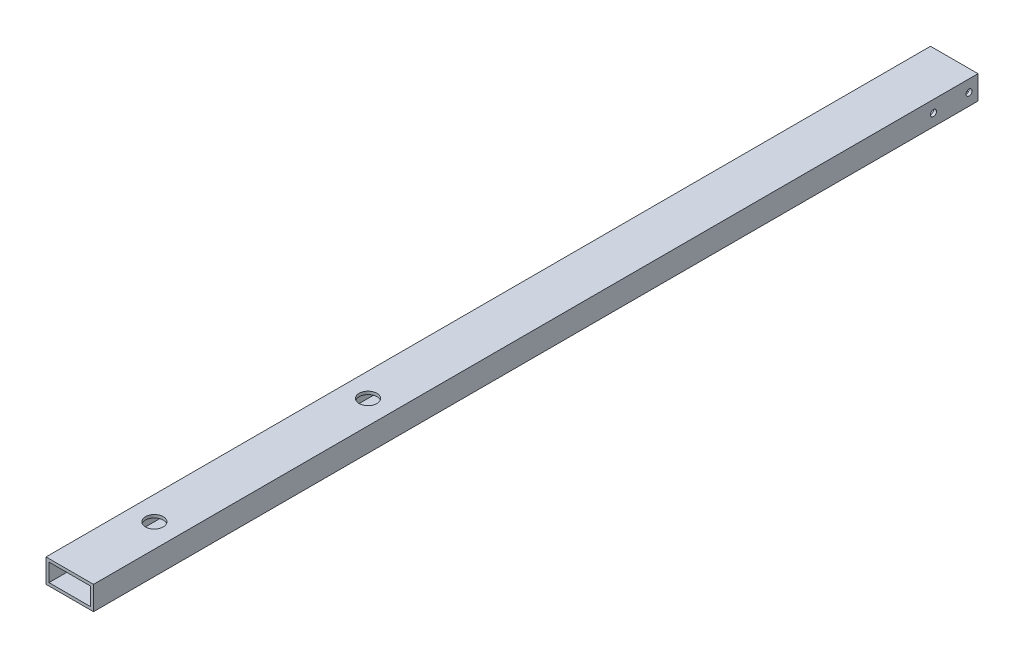
ISO-10303-21;
HEADER;
FILE_DESCRIPTION(('STEP AP214'),'2;1');
FILE_NAME('part.step','',(''),(''),'','','');
FILE_SCHEMA(('AUTOMOTIVE_DESIGN { 1 0 10303 214 1 1 1 1 }'));
ENDSEC;
DATA;
#1=APPLICATION_CONTEXT('core data for automotive mechanical design processes');
#2=APPLICATION_PROTOCOL_DEFINITION('international standard','automotive_design',2000,#1);
#3=PRODUCT_CONTEXT('',#1,'mechanical');
#4=PRODUCT('Part','Part','',(#3));
#5=PRODUCT_RELATED_PRODUCT_CATEGORY('part','',(#4));
#6=PRODUCT_DEFINITION_FORMATION('','',#4);
#7=PRODUCT_DEFINITION_CONTEXT('part definition',#1,'design');
#8=PRODUCT_DEFINITION('design','',#6,#7);
#9=PRODUCT_DEFINITION_SHAPE('','',#8);
#10=(LENGTH_UNIT() NAMED_UNIT(*) SI_UNIT(.MILLI.,.METRE.));
#11=(NAMED_UNIT(*) PLANE_ANGLE_UNIT() SI_UNIT($,.RADIAN.));
#12=(NAMED_UNIT(*) SI_UNIT($,.STERADIAN.) SOLID_ANGLE_UNIT());
#13=UNCERTAINTY_MEASURE_WITH_UNIT(LENGTH_MEASURE(1.E-05),#10,'distance_accuracy_value','');
#14=(GEOMETRIC_REPRESENTATION_CONTEXT(3) GLOBAL_UNCERTAINTY_ASSIGNED_CONTEXT((#13)) GLOBAL_UNIT_ASSIGNED_CONTEXT((#10,
#11,#12)) REPRESENTATION_CONTEXT('',''));
#15=CARTESIAN_POINT('',(0.,0.,0.));
#16=DIRECTION('',(0.,0.,1.));
#17=DIRECTION('',(1.,0.,0.));
#18=AXIS2_PLACEMENT_3D('',#15,#16,#17);
#19=CARTESIAN_POINT('',(25.4,12.039999999,855.6752));
#20=DIRECTION('',(0.,1.,0.));
#21=DIRECTION('',(0.,0.,1.));
#22=AXIS2_PLACEMENT_3D('',#19,#20,#21);
#23=CYLINDRICAL_SURFACE('',#22,9.525);
#24=CARTESIAN_POINT('',(25.4,0.,855.6752));
#25=DIRECTION('',(0.,1.,0.));
#26=DIRECTION('',(0.,0.,1.));
#27=AXIS2_PLACEMENT_3D('',#24,#25,#26);
#28=CIRCLE('',#27,9.525);
#29=CARTESIAN_POINT('',(25.4,0.,865.2002));
#30=VERTEX_POINT('',#29);
#31=EDGE_CURVE('E20',#30,#30,#28,.T.);
#32=ORIENTED_EDGE('',*,*,#31,.F.);
#33=EDGE_LOOP('',(#32));
#34=FACE_BOUND('',#33,.T.);
#35=CARTESIAN_POINT('',(25.4,3.175,855.6752));
#36=DIRECTION('',(0.,1.,0.));
#37=DIRECTION('',(0.,0.,1.));
#38=AXIS2_PLACEMENT_3D('',#35,#36,#37);
#39=CIRCLE('',#38,9.525);
#40=CARTESIAN_POINT('',(25.4,3.175,865.2002));
#41=VERTEX_POINT('',#40);
#42=EDGE_CURVE('E125',#41,#41,#39,.T.);
#43=ORIENTED_EDGE('',*,*,#42,.T.);
#44=EDGE_LOOP('',(#43));
#45=FACE_BOUND('',#44,.T.);
#46=ADVANCED_FACE('F17',(#34,#45),#23,.F.);
#47=CARTESIAN_POINT('',(25.4,12.039999999,627.0752));
#48=DIRECTION('',(0.,1.,0.));
#49=DIRECTION('',(0.,0.,1.));
#50=AXIS2_PLACEMENT_3D('',#47,#48,#49);
#51=CYLINDRICAL_SURFACE('',#50,9.525);
#52=CARTESIAN_POINT('',(25.4,0.,627.0752));
#53=DIRECTION('',(0.,1.,0.));
#54=DIRECTION('',(0.,0.,1.));
#55=AXIS2_PLACEMENT_3D('',#52,#53,#54);
#56=CIRCLE('',#55,9.525);
#57=CARTESIAN_POINT('',(25.4,0.,636.6002));
#58=VERTEX_POINT('',#57);
#59=EDGE_CURVE('E163',#58,#58,#56,.T.);
#60=ORIENTED_EDGE('',*,*,#59,.F.);
#61=EDGE_LOOP('',(#60));
#62=FACE_BOUND('',#61,.T.);
#63=CARTESIAN_POINT('',(25.4,3.175,627.0752));
#64=DIRECTION('',(0.,1.,0.));
#65=DIRECTION('',(0.,0.,1.));
#66=AXIS2_PLACEMENT_3D('',#63,#64,#65);
#67=CIRCLE('',#66,9.525);
#68=CARTESIAN_POINT('',(25.4,3.175,636.6002));
#69=VERTEX_POINT('',#68);
#70=EDGE_CURVE('E123',#69,#69,#67,.T.);
#71=ORIENTED_EDGE('',*,*,#70,.T.);
#72=EDGE_LOOP('',(#71));
#73=FACE_BOUND('',#72,.T.);
#74=ADVANCED_FACE('F175',(#62,#73),#51,.F.);
#75=CARTESIAN_POINT('',(24.7399999992,12.7,47.625));
#76=DIRECTION('',(1.,0.,0.));
#77=DIRECTION('',(0.,0.,-1.));
#78=AXIS2_PLACEMENT_3D('',#75,#76,#77);
#79=CYLINDRICAL_SURFACE('',#78,3.2639);
#80=CARTESIAN_POINT('',(50.8,12.7,47.625));
#81=DIRECTION('',(1.,0.,0.));
#82=DIRECTION('',(0.,0.,-1.));
#83=AXIS2_PLACEMENT_3D('',#80,#81,#82);
#84=CIRCLE('',#83,3.2639);
#85=CARTESIAN_POINT('',(50.8,12.7,44.3611));
#86=VERTEX_POINT('',#85);
#87=EDGE_CURVE('E118',#86,#86,#84,.F.);
#88=ORIENTED_EDGE('',*,*,#87,.F.);
#89=EDGE_LOOP('',(#88));
#90=FACE_BOUND('',#89,.T.);
#91=CARTESIAN_POINT('',(47.625,12.7,47.625));
#92=DIRECTION('',(1.,0.,0.));
#93=DIRECTION('',(0.,0.,-1.));
#94=AXIS2_PLACEMENT_3D('',#91,#92,#93);
#95=CIRCLE('',#94,3.2639);
#96=CARTESIAN_POINT('',(47.625,12.7,44.3611));
#97=VERTEX_POINT('',#96);
#98=EDGE_CURVE('E161',#97,#97,#95,.F.);
#99=ORIENTED_EDGE('',*,*,#98,.T.);
#100=EDGE_LOOP('',(#99));
#101=FACE_BOUND('',#100,.T.);
#102=ADVANCED_FACE('F287',(#90,#101),#79,.F.);
#103=CARTESIAN_POINT('',(24.7399999992,12.7,9.525));
#104=DIRECTION('',(1.,0.,0.));
#105=DIRECTION('',(0.,0.,-1.));
#106=AXIS2_PLACEMENT_3D('',#103,#104,#105);
#107=CYLINDRICAL_SURFACE('',#106,3.2639);
#108=CARTESIAN_POINT('',(50.8,12.7,9.525));
#109=DIRECTION('',(1.,0.,0.));
#110=DIRECTION('',(0.,0.,-1.));
#111=AXIS2_PLACEMENT_3D('',#108,#109,#110);
#112=CIRCLE('',#111,3.2639);
#113=CARTESIAN_POINT('',(50.8,12.7,6.2611));
#114=VERTEX_POINT('',#113);
#115=EDGE_CURVE('E114',#114,#114,#112,.F.);
#116=ORIENTED_EDGE('',*,*,#115,.F.);
#117=EDGE_LOOP('',(#116));
#118=FACE_BOUND('',#117,.T.);
#119=CARTESIAN_POINT('',(47.625,12.7,9.525));
#120=DIRECTION('',(1.,0.,0.));
#121=DIRECTION('',(0.,0.,-1.));
#122=AXIS2_PLACEMENT_3D('',#119,#120,#121);
#123=CIRCLE('',#122,3.2639);
#124=CARTESIAN_POINT('',(47.625,12.7,6.2611));
#125=VERTEX_POINT('',#124);
#126=EDGE_CURVE('E126',#125,#125,#123,.F.);
#127=ORIENTED_EDGE('',*,*,#126,.T.);
#128=EDGE_LOOP('',(#127));
#129=FACE_BOUND('',#128,.T.);
#130=ADVANCED_FACE('F283',(#118,#129),#107,.F.);
#131=CARTESIAN_POINT('',(24.7399999992,12.7,47.625));
#132=DIRECTION('',(1.,0.,0.));
#133=DIRECTION('',(0.,0.,-1.));
#134=AXIS2_PLACEMENT_3D('',#131,#132,#133);
#135=CYLINDRICAL_SURFACE('',#134,3.2639);
#136=CARTESIAN_POINT('',(0.,12.7,47.625));
#137=DIRECTION('',(1.,0.,0.));
#138=DIRECTION('',(0.,0.,-1.));
#139=AXIS2_PLACEMENT_3D('',#136,#137,#138);
#140=CIRCLE('',#139,3.2639);
#141=CARTESIAN_POINT('',(0.,12.7,44.3611));
#142=VERTEX_POINT('',#141);
#143=EDGE_CURVE('E143',#142,#142,#140,.T.);
#144=ORIENTED_EDGE('',*,*,#143,.F.);
#145=EDGE_LOOP('',(#144));
#146=FACE_BOUND('',#145,.T.);
#147=CARTESIAN_POINT('',(3.175,12.7,47.625));
#148=DIRECTION('',(1.,0.,0.));
#149=DIRECTION('',(0.,0.,-1.));
#150=AXIS2_PLACEMENT_3D('',#147,#148,#149);
#151=CIRCLE('',#150,3.2639);
#152=CARTESIAN_POINT('',(3.175,12.7,44.3611));
#153=VERTEX_POINT('',#152);
#154=EDGE_CURVE('E122',#153,#153,#151,.T.);
#155=ORIENTED_EDGE('',*,*,#154,.T.);
#156=EDGE_LOOP('',(#155));
#157=FACE_BOUND('',#156,.T.);
#158=ADVANCED_FACE('F279',(#146,#157),#135,.F.);
#159=CARTESIAN_POINT('',(24.7399999992,12.7,9.525));
#160=DIRECTION('',(1.,0.,0.));
#161=DIRECTION('',(0.,0.,-1.));
#162=AXIS2_PLACEMENT_3D('',#159,#160,#161);
#163=CYLINDRICAL_SURFACE('',#162,3.2639);
#164=CARTESIAN_POINT('',(0.,12.7,9.525));
#165=DIRECTION('',(1.,0.,0.));
#166=DIRECTION('',(0.,0.,-1.));
#167=AXIS2_PLACEMENT_3D('',#164,#165,#166);
#168=CIRCLE('',#167,3.2639);
#169=CARTESIAN_POINT('',(0.,12.7,6.2611));
#170=VERTEX_POINT('',#169);
#171=EDGE_CURVE('E139',#170,#170,#168,.T.);
#172=ORIENTED_EDGE('',*,*,#171,.F.);
#173=EDGE_LOOP('',(#172));
#174=FACE_BOUND('',#173,.T.);
#175=CARTESIAN_POINT('',(3.175,12.7,9.525));
#176=DIRECTION('',(1.,0.,0.));
#177=DIRECTION('',(0.,0.,-1.));
#178=AXIS2_PLACEMENT_3D('',#175,#176,#177);
#179=CIRCLE('',#178,3.2639);
#180=CARTESIAN_POINT('',(3.175,12.7,6.2611));
#181=VERTEX_POINT('',#180);
#182=EDGE_CURVE('E91',#181,#181,#179,.T.);
#183=ORIENTED_EDGE('',*,*,#182,.T.);
#184=EDGE_LOOP('',(#183));
#185=FACE_BOUND('',#184,.T.);
#186=ADVANCED_FACE('F276',(#174,#185),#163,.F.);
#187=CARTESIAN_POINT('',(0.,0.,0.));
#188=DIRECTION('',(0.,-1.,0.));
#189=DIRECTION('',(0.,0.,-1.));
#190=AXIS2_PLACEMENT_3D('',#187,#188,#189);
#191=PLANE('',#190);
#192=ORIENTED_EDGE('',*,*,#59,.T.);
#193=EDGE_LOOP('',(#192));
#194=FACE_BOUND('',#193,.T.);
#195=ORIENTED_EDGE('',*,*,#31,.T.);
#196=EDGE_LOOP('',(#195));
#197=FACE_BOUND('',#196,.T.);
#198=DIRECTION('',(0.,0.,-1.));
#199=VECTOR('',#198,1.);
#200=CARTESIAN_POINT('',(50.8,0.,0.));
#201=LINE('',#200,#199);
#202=CARTESIAN_POINT('',(50.8,0.,946.15));
#203=VERTEX_POINT('',#202);
#204=CARTESIAN_POINT('',(50.8,0.,0.));
#205=VERTEX_POINT('',#204);
#206=EDGE_CURVE('E115',#203,#205,#201,.T.);
#207=ORIENTED_EDGE('',*,*,#206,.F.);
#208=DIRECTION('',(1.,0.,0.));
#209=VECTOR('',#208,1.);
#210=CARTESIAN_POINT('',(0.,0.,946.15));
#211=LINE('',#210,#209);
#212=CARTESIAN_POINT('',(0.,0.,946.15));
#213=VERTEX_POINT('',#212);
#214=EDGE_CURVE('E142',#213,#203,#211,.T.);
#215=ORIENTED_EDGE('',*,*,#214,.F.);
#216=DIRECTION('',(0.,0.,1.));
#217=VECTOR('',#216,1.);
#218=CARTESIAN_POINT('',(0.,0.,0.));
#219=LINE('',#218,#217);
#220=CARTESIAN_POINT('',(0.,0.,0.));
#221=VERTEX_POINT('',#220);
#222=EDGE_CURVE('E146',#221,#213,#219,.T.);
#223=ORIENTED_EDGE('',*,*,#222,.F.);
#224=DIRECTION('',(1.,0.,0.));
#225=VECTOR('',#224,1.);
#226=CARTESIAN_POINT('',(0.,0.,0.));
#227=LINE('',#226,#225);
#228=EDGE_CURVE('E111',#221,#205,#227,.T.);
#229=ORIENTED_EDGE('',*,*,#228,.T.);
#230=EDGE_LOOP('',(#207,#215,#223,#229));
#231=FACE_BOUND('',#230,.T.);
#232=ADVANCED_FACE('F170',(#194,#197,#231),#191,.T.);
#233=CARTESIAN_POINT('',(47.625,3.175,0.));
#234=DIRECTION('',(1.,0.,0.));
#235=DIRECTION('',(0.,0.,-1.));
#236=AXIS2_PLACEMENT_3D('',#233,#234,#235);
#237=PLANE('',#236);
#238=ORIENTED_EDGE('',*,*,#126,.F.);
#239=EDGE_LOOP('',(#238));
#240=FACE_BOUND('',#239,.T.);
#241=ORIENTED_EDGE('',*,*,#98,.F.);
#242=EDGE_LOOP('',(#241));
#243=FACE_BOUND('',#242,.T.);
#244=DIRECTION('',(0.,0.,1.));
#245=VECTOR('',#244,1.);
#246=CARTESIAN_POINT('',(47.625,22.225,0.));
#247=LINE('',#246,#245);
#248=CARTESIAN_POINT('',(47.625,22.225,946.15));
#249=VERTEX_POINT('',#248);
#250=CARTESIAN_POINT('',(47.625,22.225,0.));
#251=VERTEX_POINT('',#250);
#252=EDGE_CURVE('E79',#249,#251,#247,.F.);
#253=ORIENTED_EDGE('',*,*,#252,.T.);
#254=DIRECTION('',(0.,1.,0.));
#255=VECTOR('',#254,1.);
#256=CARTESIAN_POINT('',(47.625,0.,0.));
#257=LINE('',#256,#255);
#258=CARTESIAN_POINT('',(47.625,3.175,0.));
#259=VERTEX_POINT('',#258);
#260=EDGE_CURVE('E83',#251,#259,#257,.F.);
#261=ORIENTED_EDGE('',*,*,#260,.T.);
#262=DIRECTION('',(0.,0.,-1.));
#263=VECTOR('',#262,1.);
#264=CARTESIAN_POINT('',(47.625,3.175,0.));
#265=LINE('',#264,#263);
#266=CARTESIAN_POINT('',(47.625,3.175,946.15));
#267=VERTEX_POINT('',#266);
#268=EDGE_CURVE('E124',#259,#267,#265,.F.);
#269=ORIENTED_EDGE('',*,*,#268,.T.);
#270=DIRECTION('',(0.,1.,0.));
#271=VECTOR('',#270,1.);
#272=CARTESIAN_POINT('',(47.625,0.,946.15));
#273=LINE('',#272,#271);
#274=EDGE_CURVE('E86',#249,#267,#273,.F.);
#275=ORIENTED_EDGE('',*,*,#274,.F.);
#276=EDGE_LOOP('',(#253,#261,#269,#275));
#277=FACE_BOUND('',#276,.T.);
#278=ADVANCED_FACE('F81',(#240,#243,#277),#237,.F.);
#279=CARTESIAN_POINT('',(3.175,3.175,0.));
#280=DIRECTION('',(0.,-1.,0.));
#281=DIRECTION('',(0.,0.,-1.));
#282=AXIS2_PLACEMENT_3D('',#279,#280,#281);
#283=PLANE('',#282);
#284=ORIENTED_EDGE('',*,*,#70,.F.);
#285=EDGE_LOOP('',(#284));
#286=FACE_BOUND('',#285,.T.);
#287=ORIENTED_EDGE('',*,*,#42,.F.);
#288=EDGE_LOOP('',(#287));
#289=FACE_BOUND('',#288,.T.);
#290=ORIENTED_EDGE('',*,*,#268,.F.);
#291=DIRECTION('',(1.,0.,0.));
#292=VECTOR('',#291,1.);
#293=CARTESIAN_POINT('',(0.,3.175,0.));
#294=LINE('',#293,#292);
#295=CARTESIAN_POINT('',(3.175,3.175,0.));
#296=VERTEX_POINT('',#295);
#297=EDGE_CURVE('E104',#259,#296,#294,.F.);
#298=ORIENTED_EDGE('',*,*,#297,.T.);
#299=DIRECTION('',(0.,0.,1.));
#300=VECTOR('',#299,1.);
#301=CARTESIAN_POINT('',(3.175,3.175,0.));
#302=LINE('',#301,#300);
#303=CARTESIAN_POINT('',(3.175,3.175,946.15));
#304=VERTEX_POINT('',#303);
#305=EDGE_CURVE('E120',#296,#304,#302,.T.);
#306=ORIENTED_EDGE('',*,*,#305,.T.);
#307=DIRECTION('',(1.,0.,0.));
#308=VECTOR('',#307,1.);
#309=CARTESIAN_POINT('',(0.,3.175,946.15));
#310=LINE('',#309,#308);
#311=EDGE_CURVE('E187',#267,#304,#310,.F.);
#312=ORIENTED_EDGE('',*,*,#311,.F.);
#313=EDGE_LOOP('',(#290,#298,#306,#312));
#314=FACE_BOUND('',#313,.T.);
#315=ADVANCED_FACE('F178',(#286,#289,#314),#283,.F.);
#316=CARTESIAN_POINT('',(3.175,22.225,0.));
#317=DIRECTION('',(-1.,0.,0.));
#318=DIRECTION('',(0.,0.,1.));
#319=AXIS2_PLACEMENT_3D('',#316,#317,#318);
#320=PLANE('',#319);
#321=ORIENTED_EDGE('',*,*,#182,.F.);
#322=EDGE_LOOP('',(#321));
#323=FACE_BOUND('',#322,.T.);
#324=ORIENTED_EDGE('',*,*,#154,.F.);
#325=EDGE_LOOP('',(#324));
#326=FACE_BOUND('',#325,.T.);
#327=ORIENTED_EDGE('',*,*,#305,.F.);
#328=DIRECTION('',(0.,1.,0.));
#329=VECTOR('',#328,1.);
#330=CARTESIAN_POINT('',(3.175,0.,0.));
#331=LINE('',#330,#329);
#332=CARTESIAN_POINT('',(3.175,22.225,0.));
#333=VERTEX_POINT('',#332);
#334=EDGE_CURVE('E106',#296,#333,#331,.T.);
#335=ORIENTED_EDGE('',*,*,#334,.T.);
#336=DIRECTION('',(0.,0.,1.));
#337=VECTOR('',#336,1.);
#338=CARTESIAN_POINT('',(3.175,22.225,0.));
#339=LINE('',#338,#337);
#340=CARTESIAN_POINT('',(3.175,22.225,946.15));
#341=VERTEX_POINT('',#340);
#342=EDGE_CURVE('E90',#333,#341,#339,.T.);
#343=ORIENTED_EDGE('',*,*,#342,.T.);
#344=DIRECTION('',(0.,1.,0.));
#345=VECTOR('',#344,1.);
#346=CARTESIAN_POINT('',(3.175,0.,946.15));
#347=LINE('',#346,#345);
#348=EDGE_CURVE('E138',#304,#341,#347,.T.);
#349=ORIENTED_EDGE('',*,*,#348,.F.);
#350=EDGE_LOOP('',(#327,#335,#343,#349));
#351=FACE_BOUND('',#350,.T.);
#352=ADVANCED_FACE('F181',(#323,#326,#351),#320,.F.);
#353=CARTESIAN_POINT('',(47.625,22.225,0.));
#354=DIRECTION('',(0.,1.,0.));
#355=DIRECTION('',(0.,0.,1.));
#356=AXIS2_PLACEMENT_3D('',#353,#354,#355);
#357=PLANE('',#356);
#358=CARTESIAN_POINT('',(25.4,22.225,627.0752));
#359=DIRECTION('',(0.,1.,0.));
#360=DIRECTION('',(0.,0.,1.));
#361=AXIS2_PLACEMENT_3D('',#358,#359,#360);
#362=CIRCLE('',#361,9.525);
#363=CARTESIAN_POINT('',(25.4,22.225,636.6002));
#364=VERTEX_POINT('',#363);
#365=EDGE_CURVE('E131',#364,#364,#362,.T.);
#366=ORIENTED_EDGE('',*,*,#365,.T.);
#367=EDGE_LOOP('',(#366));
#368=FACE_BOUND('',#367,.T.);
#369=CARTESIAN_POINT('',(25.4,22.225,855.6752));
#370=DIRECTION('',(0.,1.,0.));
#371=DIRECTION('',(0.,0.,1.));
#372=AXIS2_PLACEMENT_3D('',#369,#370,#371);
#373=CIRCLE('',#372,9.525);
#374=CARTESIAN_POINT('',(25.4,22.225,865.2002));
#375=VERTEX_POINT('',#374);
#376=EDGE_CURVE('E135',#375,#375,#373,.T.);
#377=ORIENTED_EDGE('',*,*,#376,.T.);
#378=EDGE_LOOP('',(#377));
#379=FACE_BOUND('',#378,.T.);
#380=ORIENTED_EDGE('',*,*,#342,.F.);
#381=DIRECTION('',(1.,0.,0.));
#382=VECTOR('',#381,1.);
#383=CARTESIAN_POINT('',(0.,22.225,0.));
#384=LINE('',#383,#382);
#385=EDGE_CURVE('E94',#333,#251,#384,.T.);
#386=ORIENTED_EDGE('',*,*,#385,.T.);
#387=ORIENTED_EDGE('',*,*,#252,.F.);
#388=DIRECTION('',(1.,0.,0.));
#389=VECTOR('',#388,1.);
#390=CARTESIAN_POINT('',(0.,22.225,946.15));
#391=LINE('',#390,#389);
#392=EDGE_CURVE('E194',#341,#249,#391,.T.);
#393=ORIENTED_EDGE('',*,*,#392,.F.);
#394=EDGE_LOOP('',(#380,#386,#387,#393));
#395=FACE_BOUND('',#394,.T.);
#396=ADVANCED_FACE('F95',(#368,#379,#395),#357,.F.);
#397=CARTESIAN_POINT('',(50.8,0.,0.));
#398=DIRECTION('',(1.,0.,0.));
#399=DIRECTION('',(0.,0.,-1.));
#400=AXIS2_PLACEMENT_3D('',#397,#398,#399);
#401=PLANE('',#400);
#402=ORIENTED_EDGE('',*,*,#115,.T.);
#403=EDGE_LOOP('',(#402));
#404=FACE_BOUND('',#403,.T.);
#405=ORIENTED_EDGE('',*,*,#87,.T.);
#406=EDGE_LOOP('',(#405));
#407=FACE_BOUND('',#406,.T.);
#408=DIRECTION('',(0.,0.,1.));
#409=VECTOR('',#408,1.);
#410=CARTESIAN_POINT('',(50.8,25.4,0.));
#411=LINE('',#410,#409);
#412=CARTESIAN_POINT('',(50.8,25.4,946.15));
#413=VERTEX_POINT('',#412);
#414=CARTESIAN_POINT('',(50.8,25.4,0.));
#415=VERTEX_POINT('',#414);
#416=EDGE_CURVE('E134',#413,#415,#411,.F.);
#417=ORIENTED_EDGE('',*,*,#416,.F.);
#418=DIRECTION('',(0.,1.,0.));
#419=VECTOR('',#418,1.);
#420=CARTESIAN_POINT('',(50.8,0.,946.15));
#421=LINE('',#420,#419);
#422=EDGE_CURVE('E200',#203,#413,#421,.T.);
#423=ORIENTED_EDGE('',*,*,#422,.F.);
#424=ORIENTED_EDGE('',*,*,#206,.T.);
#425=DIRECTION('',(0.,1.,0.));
#426=VECTOR('',#425,1.);
#427=CARTESIAN_POINT('',(50.8,0.,0.));
#428=LINE('',#427,#426);
#429=EDGE_CURVE('E99',#205,#415,#428,.T.);
#430=ORIENTED_EDGE('',*,*,#429,.T.);
#431=EDGE_LOOP('',(#417,#423,#424,#430));
#432=FACE_BOUND('',#431,.T.);
#433=ADVANCED_FACE('F223',(#404,#407,#432),#401,.T.);
#434=CARTESIAN_POINT('',(0.,0.,0.));
#435=DIRECTION('',(0.,0.,1.));
#436=DIRECTION('',(1.,0.,0.));
#437=AXIS2_PLACEMENT_3D('',#434,#435,#436);
#438=PLANE('',#437);
#439=ORIENTED_EDGE('',*,*,#297,.F.);
#440=ORIENTED_EDGE('',*,*,#260,.F.);
#441=ORIENTED_EDGE('',*,*,#385,.F.);
#442=ORIENTED_EDGE('',*,*,#334,.F.);
#443=EDGE_LOOP('',(#439,#440,#441,#442));
#444=FACE_BOUND('',#443,.T.);
#445=DIRECTION('',(1.,0.,0.));
#446=VECTOR('',#445,1.);
#447=CARTESIAN_POINT('',(50.8,25.4,0.));
#448=LINE('',#447,#446);
#449=CARTESIAN_POINT('',(0.,25.4,0.));
#450=VERTEX_POINT('',#449);
#451=EDGE_CURVE('E212',#415,#450,#448,.F.);
#452=ORIENTED_EDGE('',*,*,#451,.F.);
#453=ORIENTED_EDGE('',*,*,#429,.F.);
#454=ORIENTED_EDGE('',*,*,#228,.F.);
#455=DIRECTION('',(0.,1.,0.));
#456=VECTOR('',#455,1.);
#457=CARTESIAN_POINT('',(0.,25.4,0.));
#458=LINE('',#457,#456);
#459=EDGE_CURVE('E206',#450,#221,#458,.F.);
#460=ORIENTED_EDGE('',*,*,#459,.F.);
#461=EDGE_LOOP('',(#452,#453,#454,#460));
#462=FACE_BOUND('',#461,.T.);
#463=ADVANCED_FACE('F102',(#444,#462),#438,.F.);
#464=CARTESIAN_POINT('',(0.,25.4,0.));
#465=DIRECTION('',(-1.,0.,0.));
#466=DIRECTION('',(0.,0.,1.));
#467=AXIS2_PLACEMENT_3D('',#464,#465,#466);
#468=PLANE('',#467);
#469=ORIENTED_EDGE('',*,*,#171,.T.);
#470=EDGE_LOOP('',(#469));
#471=FACE_BOUND('',#470,.T.);
#472=ORIENTED_EDGE('',*,*,#143,.T.);
#473=EDGE_LOOP('',(#472));
#474=FACE_BOUND('',#473,.T.);
#475=ORIENTED_EDGE('',*,*,#222,.T.);
#476=DIRECTION('',(0.,1.,0.));
#477=VECTOR('',#476,1.);
#478=CARTESIAN_POINT('',(0.,0.,946.15));
#479=LINE('',#478,#477);
#480=CARTESIAN_POINT('',(0.,25.4,946.15));
#481=VERTEX_POINT('',#480);
#482=EDGE_CURVE('E35',#481,#213,#479,.F.);
#483=ORIENTED_EDGE('',*,*,#482,.F.);
#484=DIRECTION('',(0.,0.,1.));
#485=VECTOR('',#484,1.);
#486=CARTESIAN_POINT('',(0.,25.4,0.));
#487=LINE('',#486,#485);
#488=EDGE_CURVE('E215',#450,#481,#487,.T.);
#489=ORIENTED_EDGE('',*,*,#488,.F.);
#490=ORIENTED_EDGE('',*,*,#459,.T.);
#491=EDGE_LOOP('',(#475,#483,#489,#490));
#492=FACE_BOUND('',#491,.T.);
#493=ADVANCED_FACE('F227',(#471,#474,#492),#468,.T.);
#494=CARTESIAN_POINT('',(0.,0.,946.15));
#495=DIRECTION('',(0.,0.,1.));
#496=DIRECTION('',(1.,0.,0.));
#497=AXIS2_PLACEMENT_3D('',#494,#495,#496);
#498=PLANE('',#497);
#499=ORIENTED_EDGE('',*,*,#311,.T.);
#500=ORIENTED_EDGE('',*,*,#348,.T.);
#501=ORIENTED_EDGE('',*,*,#392,.T.);
#502=ORIENTED_EDGE('',*,*,#274,.T.);
#503=EDGE_LOOP('',(#499,#500,#501,#502));
#504=FACE_BOUND('',#503,.T.);
#505=DIRECTION('',(1.,0.,0.));
#506=VECTOR('',#505,1.);
#507=CARTESIAN_POINT('',(50.8,25.4,946.15));
#508=LINE('',#507,#506);
#509=EDGE_CURVE('E130',#481,#413,#508,.T.);
#510=ORIENTED_EDGE('',*,*,#509,.F.);
#511=ORIENTED_EDGE('',*,*,#482,.T.);
#512=ORIENTED_EDGE('',*,*,#214,.T.);
#513=ORIENTED_EDGE('',*,*,#422,.T.);
#514=EDGE_LOOP('',(#510,#511,#512,#513));
#515=FACE_BOUND('',#514,.T.);
#516=ADVANCED_FACE('F192',(#504,#515),#498,.T.);
#517=CARTESIAN_POINT('',(25.4,12.039999999,855.6752));
#518=DIRECTION('',(0.,1.,0.));
#519=DIRECTION('',(0.,0.,1.));
#520=AXIS2_PLACEMENT_3D('',#517,#518,#519);
#521=CYLINDRICAL_SURFACE('',#520,9.525);
#522=CARTESIAN_POINT('',(25.4,25.4,855.6752));
#523=DIRECTION('',(0.,1.,0.));
#524=DIRECTION('',(0.,0.,1.));
#525=AXIS2_PLACEMENT_3D('',#522,#523,#524);
#526=CIRCLE('',#525,9.525);
#527=CARTESIAN_POINT('',(25.4,25.4,865.2002));
#528=VERTEX_POINT('',#527);
#529=EDGE_CURVE('E26',#528,#528,#526,.F.);
#530=ORIENTED_EDGE('',*,*,#529,.F.);
#531=EDGE_LOOP('',(#530));
#532=FACE_BOUND('',#531,.T.);
#533=ORIENTED_EDGE('',*,*,#376,.F.);
#534=EDGE_LOOP('',(#533));
#535=FACE_BOUND('',#534,.T.);
#536=ADVANCED_FACE('F236',(#532,#535),#521,.F.);
#537=CARTESIAN_POINT('',(25.4,12.039999999,627.0752));
#538=DIRECTION('',(0.,1.,0.));
#539=DIRECTION('',(0.,0.,1.));
#540=AXIS2_PLACEMENT_3D('',#537,#538,#539);
#541=CYLINDRICAL_SURFACE('',#540,9.525);
#542=CARTESIAN_POINT('',(25.4,25.4,627.0752));
#543=DIRECTION('',(0.,1.,0.));
#544=DIRECTION('',(0.,0.,1.));
#545=AXIS2_PLACEMENT_3D('',#542,#543,#544);
#546=CIRCLE('',#545,9.525);
#547=CARTESIAN_POINT('',(25.4,25.4,636.6002));
#548=VERTEX_POINT('',#547);
#549=EDGE_CURVE('E11',#548,#548,#546,.F.);
#550=ORIENTED_EDGE('',*,*,#549,.F.);
#551=EDGE_LOOP('',(#550));
#552=FACE_BOUND('',#551,.T.);
#553=ORIENTED_EDGE('',*,*,#365,.F.);
#554=EDGE_LOOP('',(#553));
#555=FACE_BOUND('',#554,.T.);
#556=ADVANCED_FACE('F241',(#552,#555),#541,.F.);
#557=CARTESIAN_POINT('',(50.8,25.4,0.));
#558=DIRECTION('',(0.,1.,0.));
#559=DIRECTION('',(0.,0.,1.));
#560=AXIS2_PLACEMENT_3D('',#557,#558,#559);
#561=PLANE('',#560);
#562=ORIENTED_EDGE('',*,*,#549,.T.);
#563=EDGE_LOOP('',(#562));
#564=FACE_BOUND('',#563,.T.);
#565=ORIENTED_EDGE('',*,*,#529,.T.);
#566=EDGE_LOOP('',(#565));
#567=FACE_BOUND('',#566,.T.);
#568=ORIENTED_EDGE('',*,*,#488,.T.);
#569=ORIENTED_EDGE('',*,*,#509,.T.);
#570=ORIENTED_EDGE('',*,*,#416,.T.);
#571=ORIENTED_EDGE('',*,*,#451,.T.);
#572=EDGE_LOOP('',(#568,#569,#570,#571));
#573=FACE_BOUND('',#572,.T.);
#574=ADVANCED_FACE('F220',(#564,#567,#573),#561,.T.);
#575=CLOSED_SHELL('',(#46,#74,#102,#130,#158,#186,#232,#278,#315,#352,#396,#433,#463,#493,#516,
#536,#556,#574));
#576=MANIFOLD_SOLID_BREP('B1',#575);
#577=ADVANCED_BREP_SHAPE_REPRESENTATION('',(#18,#576),#14);
#578=SHAPE_DEFINITION_REPRESENTATION(#9,#577);
ENDSEC;
END-ISO-10303-21;
